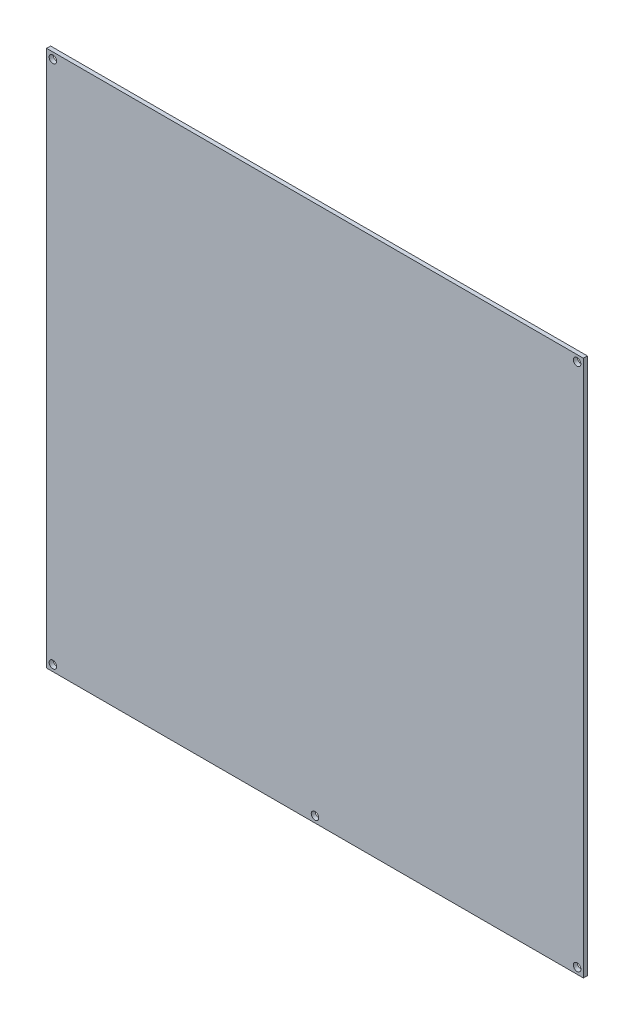
ISO-10303-21;
HEADER;
FILE_DESCRIPTION(('STEP AP214'),'2;1');
FILE_NAME('part.step','',(''),(''),'','','');
FILE_SCHEMA(('AUTOMOTIVE_DESIGN { 1 0 10303 214 1 1 1 1 }'));
ENDSEC;
DATA;
#1=APPLICATION_CONTEXT('core data for automotive mechanical design processes');
#2=APPLICATION_PROTOCOL_DEFINITION('international standard','automotive_design',2000,#1);
#3=PRODUCT_CONTEXT('',#1,'mechanical');
#4=PRODUCT('Part','Part','',(#3));
#5=PRODUCT_RELATED_PRODUCT_CATEGORY('part','',(#4));
#6=PRODUCT_DEFINITION_FORMATION('','',#4);
#7=PRODUCT_DEFINITION_CONTEXT('part definition',#1,'design');
#8=PRODUCT_DEFINITION('design','',#6,#7);
#9=PRODUCT_DEFINITION_SHAPE('','',#8);
#10=(LENGTH_UNIT() NAMED_UNIT(*) SI_UNIT(.MILLI.,.METRE.));
#11=(NAMED_UNIT(*) PLANE_ANGLE_UNIT() SI_UNIT($,.RADIAN.));
#12=(NAMED_UNIT(*) SI_UNIT($,.STERADIAN.) SOLID_ANGLE_UNIT());
#13=UNCERTAINTY_MEASURE_WITH_UNIT(LENGTH_MEASURE(1.E-05),#10,'distance_accuracy_value','');
#14=(GEOMETRIC_REPRESENTATION_CONTEXT(3) GLOBAL_UNCERTAINTY_ASSIGNED_CONTEXT((#13)) GLOBAL_UNIT_ASSIGNED_CONTEXT((#10,
#11,#12)) REPRESENTATION_CONTEXT('',''));
#15=CARTESIAN_POINT('',(0.,0.,0.));
#16=DIRECTION('',(0.,0.,1.));
#17=DIRECTION('',(1.,0.,0.));
#18=AXIS2_PLACEMENT_3D('',#15,#16,#17);
#19=CARTESIAN_POINT('',(0.,0.,1.6));
#20=DIRECTION('',(0.,0.,-1.));
#21=DIRECTION('',(-1.,0.,0.));
#22=AXIS2_PLACEMENT_3D('',#19,#20,#21);
#23=PLANE('',#22);
#24=CARTESIAN_POINT('',(104.5,-104.5,1.6));
#25=DIRECTION('',(0.,0.,1.));
#26=DIRECTION('',(-1.,0.,0.));
#27=AXIS2_PLACEMENT_3D('',#24,#25,#26);
#28=CIRCLE('',#27,1.5);
#29=CARTESIAN_POINT('',(103.,-104.5,1.6));
#30=VERTEX_POINT('',#29);
#31=EDGE_CURVE('E135',#30,#30,#28,.T.);
#32=ORIENTED_EDGE('',*,*,#31,.F.);
#33=EDGE_LOOP('',(#32));
#34=FACE_BOUND('',#33,.T.);
#35=CARTESIAN_POINT('',(104.5,104.5,1.6));
#36=DIRECTION('',(0.,0.,1.));
#37=DIRECTION('',(1.,0.,0.));
#38=AXIS2_PLACEMENT_3D('',#35,#36,#37);
#39=CIRCLE('',#38,1.5);
#40=CARTESIAN_POINT('',(106.,104.5,1.6));
#41=VERTEX_POINT('',#40);
#42=EDGE_CURVE('E123',#41,#41,#39,.T.);
#43=ORIENTED_EDGE('',*,*,#42,.F.);
#44=EDGE_LOOP('',(#43));
#45=FACE_BOUND('',#44,.T.);
#46=DIRECTION('',(0.,1.,0.));
#47=VECTOR('',#46,1.);
#48=CARTESIAN_POINT('',(107.,-107.,1.6));
#49=LINE('',#48,#47);
#50=CARTESIAN_POINT('',(107.,-107.,1.6));
#51=VERTEX_POINT('',#50);
#52=CARTESIAN_POINT('',(107.,107.,1.6));
#53=VERTEX_POINT('',#52);
#54=EDGE_CURVE('E91',#51,#53,#49,.T.);
#55=ORIENTED_EDGE('',*,*,#54,.T.);
#56=DIRECTION('',(-1.,0.,0.));
#57=VECTOR('',#56,1.);
#58=CARTESIAN_POINT('',(-107.,107.,1.6));
#59=LINE('',#58,#57);
#60=CARTESIAN_POINT('',(-107.,107.,1.6));
#61=VERTEX_POINT('',#60);
#62=EDGE_CURVE('E86',#53,#61,#59,.T.);
#63=ORIENTED_EDGE('',*,*,#62,.T.);
#64=DIRECTION('',(0.,-1.,0.));
#65=VECTOR('',#64,1.);
#66=CARTESIAN_POINT('',(-107.,-107.,1.6));
#67=LINE('',#66,#65);
#68=CARTESIAN_POINT('',(-107.,-107.,1.6));
#69=VERTEX_POINT('',#68);
#70=EDGE_CURVE('E89',#61,#69,#67,.T.);
#71=ORIENTED_EDGE('',*,*,#70,.T.);
#72=DIRECTION('',(1.,0.,0.));
#73=VECTOR('',#72,1.);
#74=CARTESIAN_POINT('',(-107.,-107.,1.6));
#75=LINE('',#74,#73);
#76=EDGE_CURVE('E56',#69,#51,#75,.T.);
#77=ORIENTED_EDGE('',*,*,#76,.T.);
#78=EDGE_LOOP('',(#55,#63,#71,#77));
#79=FACE_BOUND('',#78,.T.);
#80=CARTESIAN_POINT('',(-104.5,104.5,1.6));
#81=DIRECTION('',(0.,0.,1.));
#82=DIRECTION('',(1.,0.,0.));
#83=AXIS2_PLACEMENT_3D('',#80,#81,#82);
#84=CIRCLE('',#83,1.5);
#85=CARTESIAN_POINT('',(-103.,104.5,1.6));
#86=VERTEX_POINT('',#85);
#87=EDGE_CURVE('E108',#86,#86,#84,.T.);
#88=ORIENTED_EDGE('',*,*,#87,.F.);
#89=EDGE_LOOP('',(#88));
#90=FACE_BOUND('',#89,.T.);
#91=CARTESIAN_POINT('',(0.,-104.5,1.6));
#92=DIRECTION('',(0.,0.,1.));
#93=DIRECTION('',(1.,0.,0.));
#94=AXIS2_PLACEMENT_3D('',#91,#92,#93);
#95=CIRCLE('',#94,1.5);
#96=CARTESIAN_POINT('',(1.5,-104.5,1.6));
#97=VERTEX_POINT('',#96);
#98=EDGE_CURVE('E129',#97,#97,#95,.T.);
#99=ORIENTED_EDGE('',*,*,#98,.F.);
#100=EDGE_LOOP('',(#99));
#101=FACE_BOUND('',#100,.T.);
#102=CARTESIAN_POINT('',(-104.5,-104.5,1.6));
#103=DIRECTION('',(0.,0.,1.));
#104=DIRECTION('',(-1.,0.,0.));
#105=AXIS2_PLACEMENT_3D('',#102,#103,#104);
#106=CIRCLE('',#105,1.5);
#107=CARTESIAN_POINT('',(-106.,-104.5,1.6));
#108=VERTEX_POINT('',#107);
#109=EDGE_CURVE('E141',#108,#108,#106,.T.);
#110=ORIENTED_EDGE('',*,*,#109,.F.);
#111=EDGE_LOOP('',(#110));
#112=FACE_BOUND('',#111,.T.);
#113=ADVANCED_FACE('F39',(#34,#45,#79,#90,#101,#112),#23,.F.);
#114=CARTESIAN_POINT('',(0.,0.,0.));
#115=DIRECTION('',(0.,0.,-1.));
#116=DIRECTION('',(-1.,0.,0.));
#117=AXIS2_PLACEMENT_3D('',#114,#115,#116);
#118=PLANE('',#117);
#119=CARTESIAN_POINT('',(104.5,-104.5,0.));
#120=DIRECTION('',(0.,0.,1.));
#121=DIRECTION('',(-1.,0.,0.));
#122=AXIS2_PLACEMENT_3D('',#119,#120,#121);
#123=CIRCLE('',#122,1.5);
#124=CARTESIAN_POINT('',(103.,-104.5,0.));
#125=VERTEX_POINT('',#124);
#126=EDGE_CURVE('E138',#125,#125,#123,.T.);
#127=ORIENTED_EDGE('',*,*,#126,.T.);
#128=EDGE_LOOP('',(#127));
#129=FACE_BOUND('',#128,.T.);
#130=CARTESIAN_POINT('',(104.5,104.5,0.));
#131=DIRECTION('',(0.,0.,1.));
#132=DIRECTION('',(1.,0.,0.));
#133=AXIS2_PLACEMENT_3D('',#130,#131,#132);
#134=CIRCLE('',#133,1.5);
#135=CARTESIAN_POINT('',(106.,104.5,0.));
#136=VERTEX_POINT('',#135);
#137=EDGE_CURVE('E126',#136,#136,#134,.T.);
#138=ORIENTED_EDGE('',*,*,#137,.T.);
#139=EDGE_LOOP('',(#138));
#140=FACE_BOUND('',#139,.T.);
#141=DIRECTION('',(0.,1.,0.));
#142=VECTOR('',#141,1.);
#143=CARTESIAN_POINT('',(107.,-107.,0.));
#144=LINE('',#143,#142);
#145=CARTESIAN_POINT('',(107.,-107.,0.));
#146=VERTEX_POINT('',#145);
#147=CARTESIAN_POINT('',(107.,107.,0.));
#148=VERTEX_POINT('',#147);
#149=EDGE_CURVE('E105',#146,#148,#144,.T.);
#150=ORIENTED_EDGE('',*,*,#149,.F.);
#151=DIRECTION('',(1.,0.,0.));
#152=VECTOR('',#151,1.);
#153=CARTESIAN_POINT('',(-107.,-107.,0.));
#154=LINE('',#153,#152);
#155=CARTESIAN_POINT('',(-107.,-107.,0.));
#156=VERTEX_POINT('',#155);
#157=EDGE_CURVE('E79',#156,#146,#154,.T.);
#158=ORIENTED_EDGE('',*,*,#157,.F.);
#159=DIRECTION('',(0.,-1.,0.));
#160=VECTOR('',#159,1.);
#161=CARTESIAN_POINT('',(-107.,-107.,0.));
#162=LINE('',#161,#160);
#163=CARTESIAN_POINT('',(-107.,107.,0.));
#164=VERTEX_POINT('',#163);
#165=EDGE_CURVE('E73',#164,#156,#162,.T.);
#166=ORIENTED_EDGE('',*,*,#165,.F.);
#167=DIRECTION('',(-1.,0.,0.));
#168=VECTOR('',#167,1.);
#169=CARTESIAN_POINT('',(-107.,107.,0.));
#170=LINE('',#169,#168);
#171=EDGE_CURVE('E95',#148,#164,#170,.T.);
#172=ORIENTED_EDGE('',*,*,#171,.F.);
#173=EDGE_LOOP('',(#150,#158,#166,#172));
#174=FACE_BOUND('',#173,.T.);
#175=CARTESIAN_POINT('',(-104.5,104.5,0.));
#176=DIRECTION('',(0.,0.,1.));
#177=DIRECTION('',(1.,0.,0.));
#178=AXIS2_PLACEMENT_3D('',#175,#176,#177);
#179=CIRCLE('',#178,1.5);
#180=CARTESIAN_POINT('',(-103.,104.5,0.));
#181=VERTEX_POINT('',#180);
#182=EDGE_CURVE('E120',#181,#181,#179,.T.);
#183=ORIENTED_EDGE('',*,*,#182,.T.);
#184=EDGE_LOOP('',(#183));
#185=FACE_BOUND('',#184,.T.);
#186=CARTESIAN_POINT('',(0.,-104.5,0.));
#187=DIRECTION('',(0.,0.,1.));
#188=DIRECTION('',(1.,0.,0.));
#189=AXIS2_PLACEMENT_3D('',#186,#187,#188);
#190=CIRCLE('',#189,1.5);
#191=CARTESIAN_POINT('',(1.5,-104.5,0.));
#192=VERTEX_POINT('',#191);
#193=EDGE_CURVE('E132',#192,#192,#190,.T.);
#194=ORIENTED_EDGE('',*,*,#193,.T.);
#195=EDGE_LOOP('',(#194));
#196=FACE_BOUND('',#195,.T.);
#197=CARTESIAN_POINT('',(-104.5,-104.5,0.));
#198=DIRECTION('',(0.,0.,1.));
#199=DIRECTION('',(-1.,0.,0.));
#200=AXIS2_PLACEMENT_3D('',#197,#198,#199);
#201=CIRCLE('',#200,1.5);
#202=CARTESIAN_POINT('',(-106.,-104.5,0.));
#203=VERTEX_POINT('',#202);
#204=EDGE_CURVE('E144',#203,#203,#201,.T.);
#205=ORIENTED_EDGE('',*,*,#204,.T.);
#206=EDGE_LOOP('',(#205));
#207=FACE_BOUND('',#206,.T.);
#208=ADVANCED_FACE('F116',(#129,#140,#174,#185,#196,#207),#118,.T.);
#209=CARTESIAN_POINT('',(107.,-107.,1.6));
#210=DIRECTION('',(-1.,0.,0.));
#211=DIRECTION('',(0.,0.,1.));
#212=AXIS2_PLACEMENT_3D('',#209,#210,#211);
#213=PLANE('',#212);
#214=ORIENTED_EDGE('',*,*,#149,.T.);
#215=DIRECTION('',(0.,0.,-1.));
#216=VECTOR('',#215,1.);
#217=CARTESIAN_POINT('',(107.,107.,1.6));
#218=LINE('',#217,#216);
#219=EDGE_CURVE('E11',#53,#148,#218,.T.);
#220=ORIENTED_EDGE('',*,*,#219,.F.);
#221=ORIENTED_EDGE('',*,*,#54,.F.);
#222=DIRECTION('',(0.,0.,-1.));
#223=VECTOR('',#222,1.);
#224=CARTESIAN_POINT('',(107.,-107.,1.6));
#225=LINE('',#224,#223);
#226=EDGE_CURVE('E101',#51,#146,#225,.T.);
#227=ORIENTED_EDGE('',*,*,#226,.T.);
#228=EDGE_LOOP('',(#214,#220,#221,#227));
#229=FACE_BOUND('',#228,.T.);
#230=ADVANCED_FACE('F41',(#229),#213,.F.);
#231=CARTESIAN_POINT('',(-107.,107.,1.6));
#232=DIRECTION('',(0.,-1.,0.));
#233=DIRECTION('',(0.,0.,-1.));
#234=AXIS2_PLACEMENT_3D('',#231,#232,#233);
#235=PLANE('',#234);
#236=ORIENTED_EDGE('',*,*,#171,.T.);
#237=DIRECTION('',(0.,0.,-1.));
#238=VECTOR('',#237,1.);
#239=CARTESIAN_POINT('',(-107.,107.,1.6));
#240=LINE('',#239,#238);
#241=EDGE_CURVE('E48',#61,#164,#240,.T.);
#242=ORIENTED_EDGE('',*,*,#241,.F.);
#243=ORIENTED_EDGE('',*,*,#62,.F.);
#244=ORIENTED_EDGE('',*,*,#219,.T.);
#245=EDGE_LOOP('',(#236,#242,#243,#244));
#246=FACE_BOUND('',#245,.T.);
#247=ADVANCED_FACE('F94',(#246),#235,.F.);
#248=CARTESIAN_POINT('',(-107.,-107.,1.6));
#249=DIRECTION('',(1.,0.,0.));
#250=DIRECTION('',(0.,0.,-1.));
#251=AXIS2_PLACEMENT_3D('',#248,#249,#250);
#252=PLANE('',#251);
#253=ORIENTED_EDGE('',*,*,#165,.T.);
#254=DIRECTION('',(0.,0.,-1.));
#255=VECTOR('',#254,1.);
#256=CARTESIAN_POINT('',(-107.,-107.,1.6));
#257=LINE('',#256,#255);
#258=EDGE_CURVE('E96',#69,#156,#257,.T.);
#259=ORIENTED_EDGE('',*,*,#258,.F.);
#260=ORIENTED_EDGE('',*,*,#70,.F.);
#261=ORIENTED_EDGE('',*,*,#241,.T.);
#262=EDGE_LOOP('',(#253,#259,#260,#261));
#263=FACE_BOUND('',#262,.T.);
#264=ADVANCED_FACE('F97',(#263),#252,.F.);
#265=CARTESIAN_POINT('',(-107.,-107.,1.6));
#266=DIRECTION('',(0.,1.,0.));
#267=DIRECTION('',(0.,0.,1.));
#268=AXIS2_PLACEMENT_3D('',#265,#266,#267);
#269=PLANE('',#268);
#270=ORIENTED_EDGE('',*,*,#157,.T.);
#271=ORIENTED_EDGE('',*,*,#226,.F.);
#272=ORIENTED_EDGE('',*,*,#76,.F.);
#273=ORIENTED_EDGE('',*,*,#258,.T.);
#274=EDGE_LOOP('',(#270,#271,#272,#273));
#275=FACE_BOUND('',#274,.T.);
#276=ADVANCED_FACE('F113',(#275),#269,.F.);
#277=CARTESIAN_POINT('',(-104.5,104.5,1.6));
#278=DIRECTION('',(0.,0.,-1.));
#279=DIRECTION('',(-1.,0.,0.));
#280=AXIS2_PLACEMENT_3D('',#277,#278,#279);
#281=CYLINDRICAL_SURFACE('',#280,1.5);
#282=ORIENTED_EDGE('',*,*,#87,.T.);
#283=EDGE_LOOP('',(#282));
#284=FACE_BOUND('',#283,.T.);
#285=ORIENTED_EDGE('',*,*,#182,.F.);
#286=EDGE_LOOP('',(#285));
#287=FACE_BOUND('',#286,.T.);
#288=ADVANCED_FACE('F164',(#284,#287),#281,.F.);
#289=CARTESIAN_POINT('',(104.5,104.5,1.6));
#290=DIRECTION('',(0.,0.,-1.));
#291=DIRECTION('',(-1.,0.,0.));
#292=AXIS2_PLACEMENT_3D('',#289,#290,#291);
#293=CYLINDRICAL_SURFACE('',#292,1.5);
#294=ORIENTED_EDGE('',*,*,#42,.T.);
#295=EDGE_LOOP('',(#294));
#296=FACE_BOUND('',#295,.T.);
#297=ORIENTED_EDGE('',*,*,#137,.F.);
#298=EDGE_LOOP('',(#297));
#299=FACE_BOUND('',#298,.T.);
#300=ADVANCED_FACE('F212',(#296,#299),#293,.F.);
#301=CARTESIAN_POINT('',(0.,-104.5,1.6));
#302=DIRECTION('',(0.,0.,-1.));
#303=DIRECTION('',(-1.,0.,0.));
#304=AXIS2_PLACEMENT_3D('',#301,#302,#303);
#305=CYLINDRICAL_SURFACE('',#304,1.5);
#306=ORIENTED_EDGE('',*,*,#98,.T.);
#307=EDGE_LOOP('',(#306));
#308=FACE_BOUND('',#307,.T.);
#309=ORIENTED_EDGE('',*,*,#193,.F.);
#310=EDGE_LOOP('',(#309));
#311=FACE_BOUND('',#310,.T.);
#312=ADVANCED_FACE('F220',(#308,#311),#305,.F.);
#313=CARTESIAN_POINT('',(104.5,-104.5,1.6));
#314=DIRECTION('',(0.,0.,-1.));
#315=DIRECTION('',(-1.,0.,0.));
#316=AXIS2_PLACEMENT_3D('',#313,#314,#315);
#317=CYLINDRICAL_SURFACE('',#316,1.5);
#318=ORIENTED_EDGE('',*,*,#31,.T.);
#319=EDGE_LOOP('',(#318));
#320=FACE_BOUND('',#319,.T.);
#321=ORIENTED_EDGE('',*,*,#126,.F.);
#322=EDGE_LOOP('',(#321));
#323=FACE_BOUND('',#322,.T.);
#324=ADVANCED_FACE('F228',(#320,#323),#317,.F.);
#325=CARTESIAN_POINT('',(-104.5,-104.5,1.6));
#326=DIRECTION('',(0.,0.,-1.));
#327=DIRECTION('',(-1.,0.,0.));
#328=AXIS2_PLACEMENT_3D('',#325,#326,#327);
#329=CYLINDRICAL_SURFACE('',#328,1.5);
#330=ORIENTED_EDGE('',*,*,#109,.T.);
#331=EDGE_LOOP('',(#330));
#332=FACE_BOUND('',#331,.T.);
#333=ORIENTED_EDGE('',*,*,#204,.F.);
#334=EDGE_LOOP('',(#333));
#335=FACE_BOUND('',#334,.T.);
#336=ADVANCED_FACE('F150',(#332,#335),#329,.F.);
#337=CLOSED_SHELL('',(#113,#208,#230,#247,#264,#276,#288,#300,#312,#324,#336));
#338=MANIFOLD_SOLID_BREP('B2',#337);
#339=ADVANCED_BREP_SHAPE_REPRESENTATION('',(#18,#338),#14);
#340=SHAPE_DEFINITION_REPRESENTATION(#9,#339);
ENDSEC;
END-ISO-10303-21;
